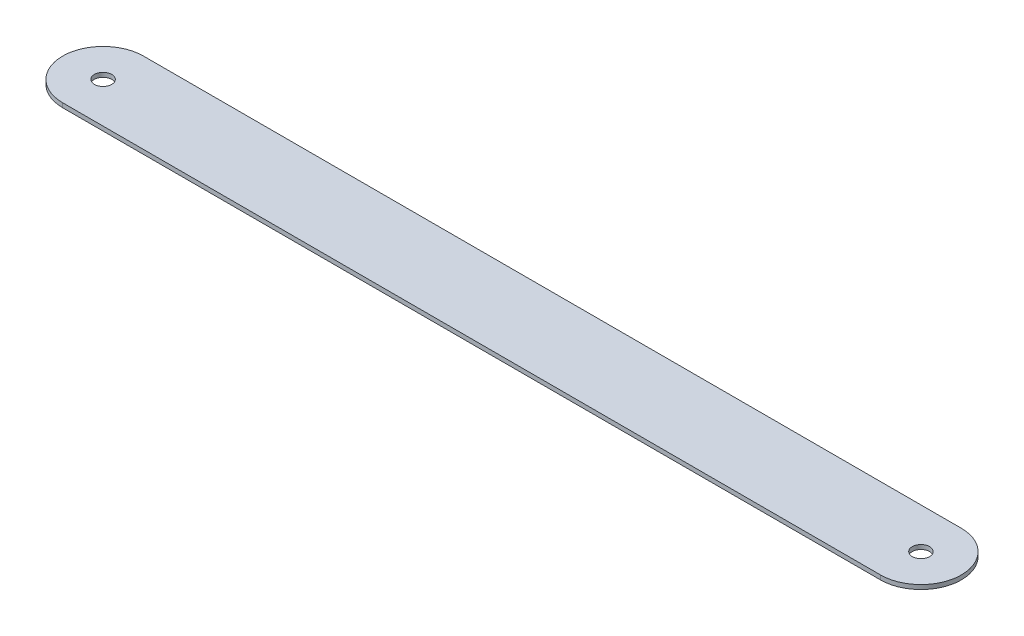
ISO-10303-21;
HEADER;
FILE_DESCRIPTION(('STEP AP214'),'2;1');
FILE_NAME('part.step','',(''),(''),'','','');
FILE_SCHEMA(('AUTOMOTIVE_DESIGN { 1 0 10303 214 1 1 1 1 }'));
ENDSEC;
DATA;
#1=APPLICATION_CONTEXT('core data for automotive mechanical design processes');
#2=APPLICATION_PROTOCOL_DEFINITION('international standard','automotive_design',2000,#1);
#3=PRODUCT_CONTEXT('',#1,'mechanical');
#4=PRODUCT('Part','Part','',(#3));
#5=PRODUCT_RELATED_PRODUCT_CATEGORY('part','',(#4));
#6=PRODUCT_DEFINITION_FORMATION('','',#4);
#7=PRODUCT_DEFINITION_CONTEXT('part definition',#1,'design');
#8=PRODUCT_DEFINITION('design','',#6,#7);
#9=PRODUCT_DEFINITION_SHAPE('','',#8);
#10=(LENGTH_UNIT() NAMED_UNIT(*) SI_UNIT(.MILLI.,.METRE.));
#11=(NAMED_UNIT(*) PLANE_ANGLE_UNIT() SI_UNIT($,.RADIAN.));
#12=(NAMED_UNIT(*) SI_UNIT($,.STERADIAN.) SOLID_ANGLE_UNIT());
#13=UNCERTAINTY_MEASURE_WITH_UNIT(LENGTH_MEASURE(1.E-05),#10,'distance_accuracy_value','');
#14=(GEOMETRIC_REPRESENTATION_CONTEXT(3) GLOBAL_UNCERTAINTY_ASSIGNED_CONTEXT((#13)) GLOBAL_UNIT_ASSIGNED_CONTEXT((#10,
#11,#12)) REPRESENTATION_CONTEXT('',''));
#15=CARTESIAN_POINT('',(0.,0.,0.));
#16=DIRECTION('',(0.,0.,1.));
#17=DIRECTION('',(1.,0.,0.));
#18=AXIS2_PLACEMENT_3D('',#15,#16,#17);
#19=CARTESIAN_POINT('',(0.,1.5,0.));
#20=DIRECTION('',(0.,1.,0.));
#21=DIRECTION('',(0.,0.,1.));
#22=AXIS2_PLACEMENT_3D('',#19,#20,#21);
#23=PLANE('',#22);
#24=CARTESIAN_POINT('',(0.,1.5,0.));
#25=DIRECTION('',(0.,1.,0.));
#26=DIRECTION('',(0.,0.,1.));
#27=AXIS2_PLACEMENT_3D('',#24,#25,#26);
#28=CIRCLE('',#27,3.);
#29=CARTESIAN_POINT('',(0.,1.5,3.));
#30=VERTEX_POINT('',#29);
#31=EDGE_CURVE('E101',#30,#30,#28,.T.);
#32=ORIENTED_EDGE('',*,*,#31,.F.);
#33=EDGE_LOOP('',(#32));
#34=FACE_BOUND('',#33,.T.);
#35=CARTESIAN_POINT('',(0.,1.5,0.));
#36=DIRECTION('',(0.,1.,0.));
#37=DIRECTION('',(0.,0.,1.));
#38=AXIS2_PLACEMENT_3D('',#35,#36,#37);
#39=CIRCLE('',#38,14.);
#40=CARTESIAN_POINT('',(0.,1.5,-14.));
#41=VERTEX_POINT('',#40);
#42=CARTESIAN_POINT('',(0.,1.5,14.));
#43=VERTEX_POINT('',#42);
#44=EDGE_CURVE('E86',#41,#43,#39,.T.);
#45=ORIENTED_EDGE('',*,*,#44,.T.);
#46=DIRECTION('',(1.,0.,0.));
#47=VECTOR('',#46,1.);
#48=CARTESIAN_POINT('',(0.,1.5,14.));
#49=LINE('',#48,#47);
#50=CARTESIAN_POINT('',(283.23,1.5,14.));
#51=VERTEX_POINT('',#50);
#52=EDGE_CURVE('E81',#43,#51,#49,.T.);
#53=ORIENTED_EDGE('',*,*,#52,.T.);
#54=CARTESIAN_POINT('',(283.23,1.5,0.));
#55=DIRECTION('',(0.,1.,0.));
#56=DIRECTION('',(0.,0.,1.));
#57=AXIS2_PLACEMENT_3D('',#54,#55,#56);
#58=CIRCLE('',#57,14.);
#59=CARTESIAN_POINT('',(283.23,1.5,-14.));
#60=VERTEX_POINT('',#59);
#61=EDGE_CURVE('E84',#51,#60,#58,.T.);
#62=ORIENTED_EDGE('',*,*,#61,.T.);
#63=DIRECTION('',(-1.,0.,0.));
#64=VECTOR('',#63,1.);
#65=CARTESIAN_POINT('',(0.,1.5,-14.));
#66=LINE('',#65,#64);
#67=EDGE_CURVE('E51',#60,#41,#66,.T.);
#68=ORIENTED_EDGE('',*,*,#67,.T.);
#69=EDGE_LOOP('',(#45,#53,#62,#68));
#70=FACE_BOUND('',#69,.T.);
#71=CARTESIAN_POINT('',(283.23,1.5,0.));
#72=DIRECTION('',(0.,1.,0.));
#73=DIRECTION('',(0.,0.,1.));
#74=AXIS2_PLACEMENT_3D('',#71,#72,#73);
#75=CIRCLE('',#74,2.99999999999999);
#76=CARTESIAN_POINT('',(283.23,1.5,2.99999999999999));
#77=VERTEX_POINT('',#76);
#78=EDGE_CURVE('E116',#77,#77,#75,.T.);
#79=ORIENTED_EDGE('',*,*,#78,.F.);
#80=EDGE_LOOP('',(#79));
#81=FACE_BOUND('',#80,.T.);
#82=ADVANCED_FACE('F34',(#34,#70,#81),#23,.T.);
#83=CARTESIAN_POINT('',(0.,0.,0.));
#84=DIRECTION('',(0.,1.,0.));
#85=DIRECTION('',(0.,0.,1.));
#86=AXIS2_PLACEMENT_3D('',#83,#84,#85);
#87=PLANE('',#86);
#88=CARTESIAN_POINT('',(0.,0.,0.));
#89=DIRECTION('',(0.,1.,0.));
#90=DIRECTION('',(0.,0.,1.));
#91=AXIS2_PLACEMENT_3D('',#88,#89,#90);
#92=CIRCLE('',#91,14.);
#93=CARTESIAN_POINT('',(0.,0.,-14.));
#94=VERTEX_POINT('',#93);
#95=CARTESIAN_POINT('',(0.,0.,14.));
#96=VERTEX_POINT('',#95);
#97=EDGE_CURVE('E98',#94,#96,#92,.T.);
#98=ORIENTED_EDGE('',*,*,#97,.F.);
#99=DIRECTION('',(-1.,0.,0.));
#100=VECTOR('',#99,1.);
#101=CARTESIAN_POINT('',(0.,0.,-14.));
#102=LINE('',#101,#100);
#103=CARTESIAN_POINT('',(283.23,0.,-14.));
#104=VERTEX_POINT('',#103);
#105=EDGE_CURVE('E74',#104,#94,#102,.T.);
#106=ORIENTED_EDGE('',*,*,#105,.F.);
#107=CARTESIAN_POINT('',(283.23,0.,0.));
#108=DIRECTION('',(0.,1.,0.));
#109=DIRECTION('',(0.,0.,1.));
#110=AXIS2_PLACEMENT_3D('',#107,#108,#109);
#111=CIRCLE('',#110,14.);
#112=CARTESIAN_POINT('',(283.23,0.,14.));
#113=VERTEX_POINT('',#112);
#114=EDGE_CURVE('E68',#113,#104,#111,.T.);
#115=ORIENTED_EDGE('',*,*,#114,.F.);
#116=DIRECTION('',(1.,0.,0.));
#117=VECTOR('',#116,1.);
#118=CARTESIAN_POINT('',(0.,0.,14.));
#119=LINE('',#118,#117);
#120=EDGE_CURVE('E90',#96,#113,#119,.T.);
#121=ORIENTED_EDGE('',*,*,#120,.F.);
#122=EDGE_LOOP('',(#98,#106,#115,#121));
#123=FACE_BOUND('',#122,.T.);
#124=CARTESIAN_POINT('',(0.,0.,0.));
#125=DIRECTION('',(0.,1.,0.));
#126=DIRECTION('',(0.,0.,1.));
#127=AXIS2_PLACEMENT_3D('',#124,#125,#126);
#128=CIRCLE('',#127,3.);
#129=CARTESIAN_POINT('',(0.,0.,3.));
#130=VERTEX_POINT('',#129);
#131=EDGE_CURVE('E113',#130,#130,#128,.T.);
#132=ORIENTED_EDGE('',*,*,#131,.T.);
#133=EDGE_LOOP('',(#132));
#134=FACE_BOUND('',#133,.T.);
#135=CARTESIAN_POINT('',(283.23,0.,0.));
#136=DIRECTION('',(0.,1.,0.));
#137=DIRECTION('',(0.,0.,1.));
#138=AXIS2_PLACEMENT_3D('',#135,#136,#137);
#139=CIRCLE('',#138,2.99999999999999);
#140=CARTESIAN_POINT('',(283.23,0.,2.99999999999999));
#141=VERTEX_POINT('',#140);
#142=EDGE_CURVE('E119',#141,#141,#139,.T.);
#143=ORIENTED_EDGE('',*,*,#142,.T.);
#144=EDGE_LOOP('',(#143));
#145=FACE_BOUND('',#144,.T.);
#146=ADVANCED_FACE('F109',(#123,#134,#145),#87,.F.);
#147=CARTESIAN_POINT('',(0.,1.5,0.));
#148=DIRECTION('',(0.,-1.,0.));
#149=DIRECTION('',(0.,0.,-1.));
#150=AXIS2_PLACEMENT_3D('',#147,#148,#149);
#151=CYLINDRICAL_SURFACE('',#150,14.);
#152=ORIENTED_EDGE('',*,*,#97,.T.);
#153=DIRECTION('',(0.,-1.,0.));
#154=VECTOR('',#153,1.);
#155=CARTESIAN_POINT('',(0.,1.5,14.));
#156=LINE('',#155,#154);
#157=EDGE_CURVE('E11',#43,#96,#156,.T.);
#158=ORIENTED_EDGE('',*,*,#157,.F.);
#159=ORIENTED_EDGE('',*,*,#44,.F.);
#160=DIRECTION('',(0.,-1.,0.));
#161=VECTOR('',#160,1.);
#162=CARTESIAN_POINT('',(0.,1.5,-14.));
#163=LINE('',#162,#161);
#164=EDGE_CURVE('E94',#41,#94,#163,.T.);
#165=ORIENTED_EDGE('',*,*,#164,.T.);
#166=EDGE_LOOP('',(#152,#158,#159,#165));
#167=FACE_BOUND('',#166,.T.);
#168=ADVANCED_FACE('F36',(#167),#151,.T.);
#169=CARTESIAN_POINT('',(0.,1.5,14.));
#170=DIRECTION('',(0.,0.,-1.));
#171=DIRECTION('',(-1.,0.,0.));
#172=AXIS2_PLACEMENT_3D('',#169,#170,#171);
#173=PLANE('',#172);
#174=ORIENTED_EDGE('',*,*,#120,.T.);
#175=DIRECTION('',(0.,-1.,0.));
#176=VECTOR('',#175,1.);
#177=CARTESIAN_POINT('',(283.23,1.5,14.));
#178=LINE('',#177,#176);
#179=EDGE_CURVE('E43',#51,#113,#178,.T.);
#180=ORIENTED_EDGE('',*,*,#179,.F.);
#181=ORIENTED_EDGE('',*,*,#52,.F.);
#182=ORIENTED_EDGE('',*,*,#157,.T.);
#183=EDGE_LOOP('',(#174,#180,#181,#182));
#184=FACE_BOUND('',#183,.T.);
#185=ADVANCED_FACE('F89',(#184),#173,.F.);
#186=CARTESIAN_POINT('',(283.23,1.5,0.));
#187=DIRECTION('',(0.,-1.,0.));
#188=DIRECTION('',(0.,0.,-1.));
#189=AXIS2_PLACEMENT_3D('',#186,#187,#188);
#190=CYLINDRICAL_SURFACE('',#189,14.);
#191=ORIENTED_EDGE('',*,*,#114,.T.);
#192=DIRECTION('',(0.,-1.,0.));
#193=VECTOR('',#192,1.);
#194=CARTESIAN_POINT('',(283.23,1.5,-14.));
#195=LINE('',#194,#193);
#196=EDGE_CURVE('E91',#60,#104,#195,.T.);
#197=ORIENTED_EDGE('',*,*,#196,.F.);
#198=ORIENTED_EDGE('',*,*,#61,.F.);
#199=ORIENTED_EDGE('',*,*,#179,.T.);
#200=EDGE_LOOP('',(#191,#197,#198,#199));
#201=FACE_BOUND('',#200,.T.);
#202=ADVANCED_FACE('F92',(#201),#190,.T.);
#203=CARTESIAN_POINT('',(0.,1.5,-14.));
#204=DIRECTION('',(0.,0.,1.));
#205=DIRECTION('',(1.,0.,0.));
#206=AXIS2_PLACEMENT_3D('',#203,#204,#205);
#207=PLANE('',#206);
#208=ORIENTED_EDGE('',*,*,#105,.T.);
#209=ORIENTED_EDGE('',*,*,#164,.F.);
#210=ORIENTED_EDGE('',*,*,#67,.F.);
#211=ORIENTED_EDGE('',*,*,#196,.T.);
#212=EDGE_LOOP('',(#208,#209,#210,#211));
#213=FACE_BOUND('',#212,.T.);
#214=ADVANCED_FACE('F106',(#213),#207,.F.);
#215=CARTESIAN_POINT('',(0.,1.5,0.));
#216=DIRECTION('',(0.,-1.,0.));
#217=DIRECTION('',(0.,0.,-1.));
#218=AXIS2_PLACEMENT_3D('',#215,#216,#217);
#219=CYLINDRICAL_SURFACE('',#218,3.);
#220=ORIENTED_EDGE('',*,*,#31,.T.);
#221=EDGE_LOOP('',(#220));
#222=FACE_BOUND('',#221,.T.);
#223=ORIENTED_EDGE('',*,*,#131,.F.);
#224=EDGE_LOOP('',(#223));
#225=FACE_BOUND('',#224,.T.);
#226=ADVANCED_FACE('F136',(#222,#225),#219,.F.);
#227=CARTESIAN_POINT('',(283.23,1.5,0.));
#228=DIRECTION('',(0.,-1.,0.));
#229=DIRECTION('',(0.,0.,-1.));
#230=AXIS2_PLACEMENT_3D('',#227,#228,#229);
#231=CYLINDRICAL_SURFACE('',#230,2.99999999999999);
#232=ORIENTED_EDGE('',*,*,#78,.T.);
#233=EDGE_LOOP('',(#232));
#234=FACE_BOUND('',#233,.T.);
#235=ORIENTED_EDGE('',*,*,#142,.F.);
#236=EDGE_LOOP('',(#235));
#237=FACE_BOUND('',#236,.T.);
#238=ADVANCED_FACE('F125',(#234,#237),#231,.F.);
#239=CLOSED_SHELL('',(#82,#146,#168,#185,#202,#214,#226,#238));
#240=MANIFOLD_SOLID_BREP('B2',#239);
#241=ADVANCED_BREP_SHAPE_REPRESENTATION('',(#18,#240),#14);
#242=SHAPE_DEFINITION_REPRESENTATION(#9,#241);
ENDSEC;
END-ISO-10303-21;
